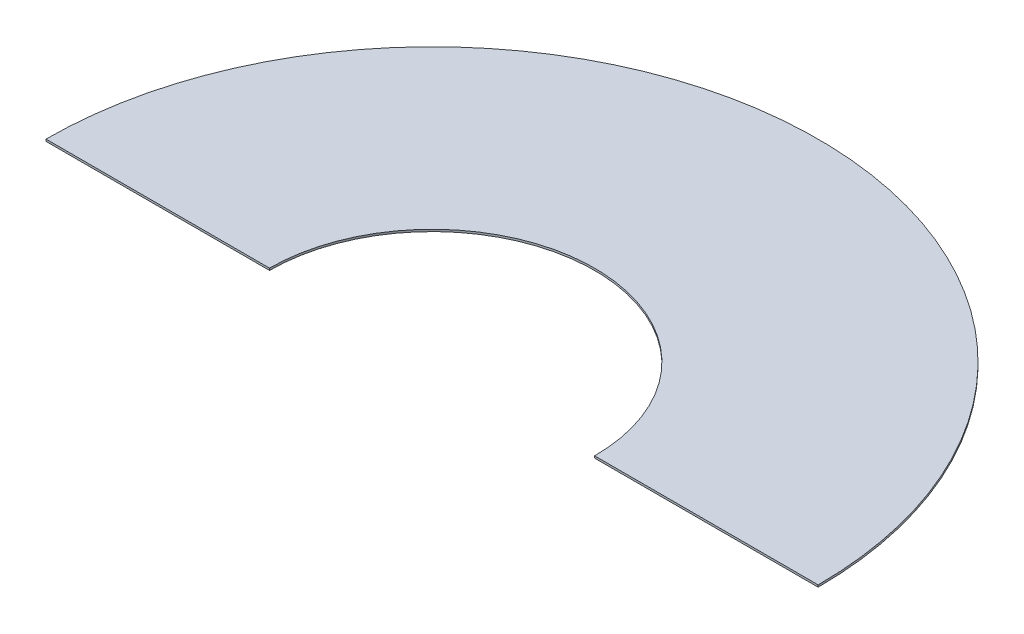
ISO-10303-21;
HEADER;
FILE_DESCRIPTION(('STEP AP214'),'2;1');
FILE_NAME('part.step','',(''),(''),'','','');
FILE_SCHEMA(('AUTOMOTIVE_DESIGN { 1 0 10303 214 1 1 1 1 }'));
ENDSEC;
DATA;
#1=APPLICATION_CONTEXT('core data for automotive mechanical design processes');
#2=APPLICATION_PROTOCOL_DEFINITION('international standard','automotive_design',2000,#1);
#3=PRODUCT_CONTEXT('',#1,'mechanical');
#4=PRODUCT('Part','Part','',(#3));
#5=PRODUCT_RELATED_PRODUCT_CATEGORY('part','',(#4));
#6=PRODUCT_DEFINITION_FORMATION('','',#4);
#7=PRODUCT_DEFINITION_CONTEXT('part definition',#1,'design');
#8=PRODUCT_DEFINITION('design','',#6,#7);
#9=PRODUCT_DEFINITION_SHAPE('','',#8);
#10=(LENGTH_UNIT() NAMED_UNIT(*) SI_UNIT(.MILLI.,.METRE.));
#11=(NAMED_UNIT(*) PLANE_ANGLE_UNIT() SI_UNIT($,.RADIAN.));
#12=(NAMED_UNIT(*) SI_UNIT($,.STERADIAN.) SOLID_ANGLE_UNIT());
#13=UNCERTAINTY_MEASURE_WITH_UNIT(LENGTH_MEASURE(1.E-05),#10,'distance_accuracy_value','');
#14=(GEOMETRIC_REPRESENTATION_CONTEXT(3) GLOBAL_UNCERTAINTY_ASSIGNED_CONTEXT((#13)) GLOBAL_UNIT_ASSIGNED_CONTEXT((#10,
#11,#12)) REPRESENTATION_CONTEXT('',''));
#15=CARTESIAN_POINT('',(0.,0.,0.));
#16=DIRECTION('',(0.,0.,1.));
#17=DIRECTION('',(1.,0.,0.));
#18=AXIS2_PLACEMENT_3D('',#15,#16,#17);
#19=CARTESIAN_POINT('',(0.,2.,0.));
#20=DIRECTION('',(0.,-1.,0.));
#21=DIRECTION('',(0.,0.,-1.));
#22=AXIS2_PLACEMENT_3D('',#19,#20,#21);
#23=CYLINDRICAL_SURFACE('',#22,380.);
#24=CARTESIAN_POINT('',(0.,0.,0.));
#25=DIRECTION('',(0.,1.,0.));
#26=DIRECTION('',(0.,0.,1.));
#27=AXIS2_PLACEMENT_3D('',#24,#25,#26);
#28=CIRCLE('',#27,380.);
#29=CARTESIAN_POINT('',(380.,0.,0.));
#30=VERTEX_POINT('',#29);
#31=CARTESIAN_POINT('',(-380.,0.,0.));
#32=VERTEX_POINT('',#31);
#33=EDGE_CURVE('E96',#30,#32,#28,.T.);
#34=ORIENTED_EDGE('',*,*,#33,.T.);
#35=DIRECTION('',(0.,-1.,0.));
#36=VECTOR('',#35,1.);
#37=CARTESIAN_POINT('',(-380.,2.,0.));
#38=LINE('',#37,#36);
#39=CARTESIAN_POINT('',(-380.,2.,0.));
#40=VERTEX_POINT('',#39);
#41=EDGE_CURVE('E11',#40,#32,#38,.T.);
#42=ORIENTED_EDGE('',*,*,#41,.F.);
#43=CARTESIAN_POINT('',(0.,2.,0.));
#44=DIRECTION('',(0.,1.,0.));
#45=DIRECTION('',(0.,0.,1.));
#46=AXIS2_PLACEMENT_3D('',#43,#44,#45);
#47=CIRCLE('',#46,380.);
#48=CARTESIAN_POINT('',(380.,2.,0.));
#49=VERTEX_POINT('',#48);
#50=EDGE_CURVE('E84',#49,#40,#47,.T.);
#51=ORIENTED_EDGE('',*,*,#50,.F.);
#52=DIRECTION('',(0.,-1.,0.));
#53=VECTOR('',#52,1.);
#54=CARTESIAN_POINT('',(380.,2.,0.));
#55=LINE('',#54,#53);
#56=EDGE_CURVE('E92',#49,#30,#55,.T.);
#57=ORIENTED_EDGE('',*,*,#56,.T.);
#58=EDGE_LOOP('',(#34,#42,#51,#57));
#59=FACE_BOUND('',#58,.T.);
#60=ADVANCED_FACE('F33',(#59),#23,.T.);
#61=CARTESIAN_POINT('',(-380.,2.,0.));
#62=DIRECTION('',(0.,0.,-1.));
#63=DIRECTION('',(-1.,0.,0.));
#64=AXIS2_PLACEMENT_3D('',#61,#62,#63);
#65=PLANE('',#64);
#66=DIRECTION('',(1.,0.,0.));
#67=VECTOR('',#66,1.);
#68=CARTESIAN_POINT('',(-380.,0.,0.));
#69=LINE('',#68,#67);
#70=CARTESIAN_POINT('',(-160.,0.,0.));
#71=VERTEX_POINT('',#70);
#72=EDGE_CURVE('E88',#32,#71,#69,.T.);
#73=ORIENTED_EDGE('',*,*,#72,.T.);
#74=DIRECTION('',(0.,-1.,0.));
#75=VECTOR('',#74,1.);
#76=CARTESIAN_POINT('',(-160.,2.,0.));
#77=LINE('',#76,#75);
#78=CARTESIAN_POINT('',(-160.,2.,0.));
#79=VERTEX_POINT('',#78);
#80=EDGE_CURVE('E41',#79,#71,#77,.T.);
#81=ORIENTED_EDGE('',*,*,#80,.F.);
#82=DIRECTION('',(1.,0.,0.));
#83=VECTOR('',#82,1.);
#84=CARTESIAN_POINT('',(-380.,2.,0.));
#85=LINE('',#84,#83);
#86=EDGE_CURVE('E79',#40,#79,#85,.T.);
#87=ORIENTED_EDGE('',*,*,#86,.F.);
#88=ORIENTED_EDGE('',*,*,#41,.T.);
#89=EDGE_LOOP('',(#73,#81,#87,#88));
#90=FACE_BOUND('',#89,.T.);
#91=ADVANCED_FACE('F87',(#90),#65,.F.);
#92=CARTESIAN_POINT('',(0.,2.,0.));
#93=DIRECTION('',(0.,-1.,0.));
#94=DIRECTION('',(0.,0.,-1.));
#95=AXIS2_PLACEMENT_3D('',#92,#93,#94);
#96=CYLINDRICAL_SURFACE('',#95,160.);
#97=CARTESIAN_POINT('',(0.,0.,0.));
#98=DIRECTION('',(0.,-1.,0.));
#99=DIRECTION('',(0.,0.,1.));
#100=AXIS2_PLACEMENT_3D('',#97,#98,#99);
#101=CIRCLE('',#100,160.);
#102=CARTESIAN_POINT('',(160.,0.,0.));
#103=VERTEX_POINT('',#102);
#104=EDGE_CURVE('E66',#71,#103,#101,.T.);
#105=ORIENTED_EDGE('',*,*,#104,.T.);
#106=DIRECTION('',(0.,-1.,0.));
#107=VECTOR('',#106,1.);
#108=CARTESIAN_POINT('',(160.,2.,0.));
#109=LINE('',#108,#107);
#110=CARTESIAN_POINT('',(160.,2.,0.));
#111=VERTEX_POINT('',#110);
#112=EDGE_CURVE('E89',#111,#103,#109,.T.);
#113=ORIENTED_EDGE('',*,*,#112,.F.);
#114=CARTESIAN_POINT('',(0.,2.,0.));
#115=DIRECTION('',(0.,-1.,0.));
#116=DIRECTION('',(0.,0.,1.));
#117=AXIS2_PLACEMENT_3D('',#114,#115,#116);
#118=CIRCLE('',#117,160.);
#119=EDGE_CURVE('E82',#79,#111,#118,.T.);
#120=ORIENTED_EDGE('',*,*,#119,.F.);
#121=ORIENTED_EDGE('',*,*,#80,.T.);
#122=EDGE_LOOP('',(#105,#113,#120,#121));
#123=FACE_BOUND('',#122,.T.);
#124=ADVANCED_FACE('F90',(#123),#96,.F.);
#125=CARTESIAN_POINT('',(160.,2.,0.));
#126=DIRECTION('',(0.,0.,-1.));
#127=DIRECTION('',(-1.,0.,0.));
#128=AXIS2_PLACEMENT_3D('',#125,#126,#127);
#129=PLANE('',#128);
#130=DIRECTION('',(1.,0.,0.));
#131=VECTOR('',#130,1.);
#132=CARTESIAN_POINT('',(160.,0.,0.));
#133=LINE('',#132,#131);
#134=EDGE_CURVE('E72',#103,#30,#133,.T.);
#135=ORIENTED_EDGE('',*,*,#134,.T.);
#136=ORIENTED_EDGE('',*,*,#56,.F.);
#137=DIRECTION('',(1.,0.,0.));
#138=VECTOR('',#137,1.);
#139=CARTESIAN_POINT('',(160.,2.,0.));
#140=LINE('',#139,#138);
#141=EDGE_CURVE('E49',#111,#49,#140,.T.);
#142=ORIENTED_EDGE('',*,*,#141,.F.);
#143=ORIENTED_EDGE('',*,*,#112,.T.);
#144=EDGE_LOOP('',(#135,#136,#142,#143));
#145=FACE_BOUND('',#144,.T.);
#146=ADVANCED_FACE('F103',(#145),#129,.F.);
#147=CARTESIAN_POINT('',(0.,2.,0.));
#148=DIRECTION('',(0.,1.,0.));
#149=DIRECTION('',(0.,0.,1.));
#150=AXIS2_PLACEMENT_3D('',#147,#148,#149);
#151=PLANE('',#150);
#152=ORIENTED_EDGE('',*,*,#50,.T.);
#153=ORIENTED_EDGE('',*,*,#86,.T.);
#154=ORIENTED_EDGE('',*,*,#119,.T.);
#155=ORIENTED_EDGE('',*,*,#141,.T.);
#156=EDGE_LOOP('',(#152,#153,#154,#155));
#157=FACE_BOUND('',#156,.T.);
#158=ADVANCED_FACE('F80',(#157),#151,.T.);
#159=CARTESIAN_POINT('',(0.,0.,0.));
#160=DIRECTION('',(0.,1.,0.));
#161=DIRECTION('',(0.,0.,1.));
#162=AXIS2_PLACEMENT_3D('',#159,#160,#161);
#163=PLANE('',#162);
#164=ORIENTED_EDGE('',*,*,#33,.F.);
#165=ORIENTED_EDGE('',*,*,#134,.F.);
#166=ORIENTED_EDGE('',*,*,#104,.F.);
#167=ORIENTED_EDGE('',*,*,#72,.F.);
#168=EDGE_LOOP('',(#164,#165,#166,#167));
#169=FACE_BOUND('',#168,.T.);
#170=ADVANCED_FACE('F106',(#169),#163,.F.);
#171=CLOSED_SHELL('',(#60,#91,#124,#146,#158,#170));
#172=MANIFOLD_SOLID_BREP('B2',#171);
#173=ADVANCED_BREP_SHAPE_REPRESENTATION('',(#18,#172),#14);
#174=SHAPE_DEFINITION_REPRESENTATION(#9,#173);
ENDSEC;
END-ISO-10303-21;
